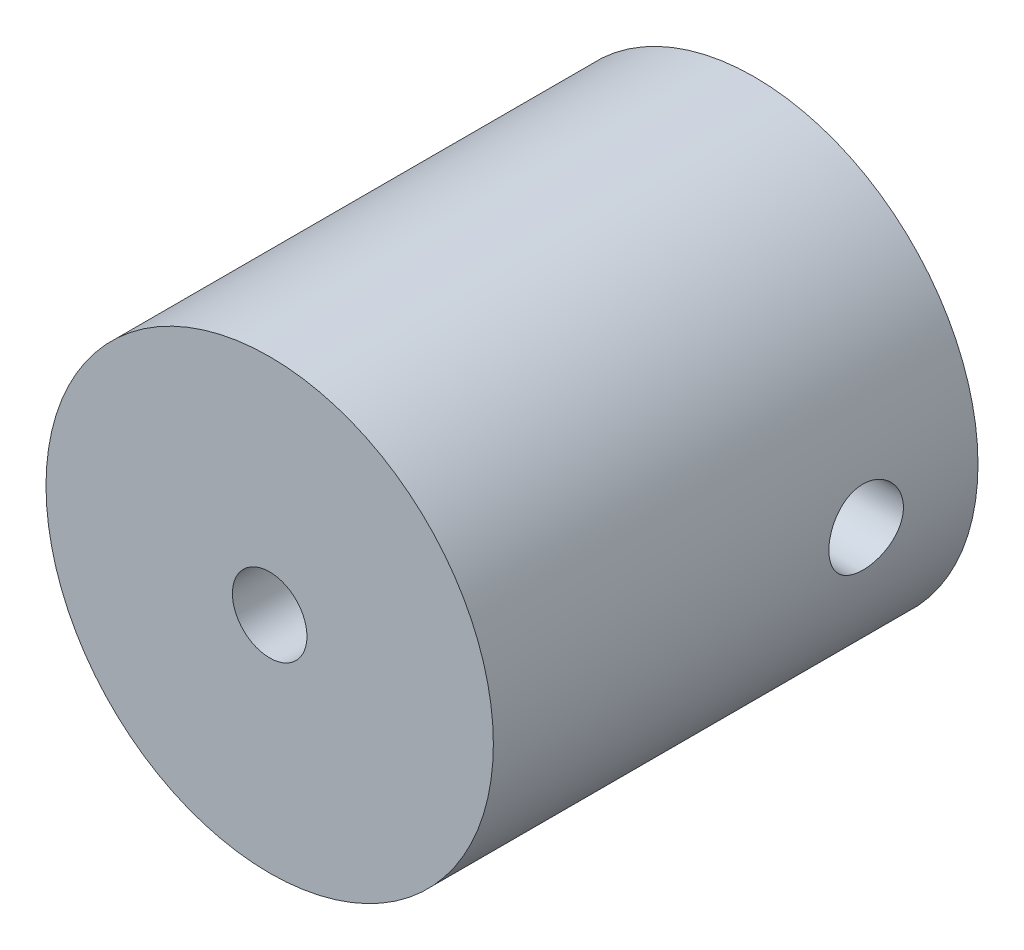
ISO-10303-21;
HEADER;
FILE_DESCRIPTION(('STEP AP214'),'2;1');
FILE_NAME('part.step','',(''),(''),'','','');
FILE_SCHEMA(('AUTOMOTIVE_DESIGN { 1 0 10303 214 1 1 1 1 }'));
ENDSEC;
DATA;
#1=APPLICATION_CONTEXT('core data for automotive mechanical design processes');
#2=APPLICATION_PROTOCOL_DEFINITION('international standard','automotive_design',2000,#1);
#3=PRODUCT_CONTEXT('',#1,'mechanical');
#4=PRODUCT('Part','Part','',(#3));
#5=PRODUCT_RELATED_PRODUCT_CATEGORY('part','',(#4));
#6=PRODUCT_DEFINITION_FORMATION('','',#4);
#7=PRODUCT_DEFINITION_CONTEXT('part definition',#1,'design');
#8=PRODUCT_DEFINITION('design','',#6,#7);
#9=PRODUCT_DEFINITION_SHAPE('','',#8);
#10=(LENGTH_UNIT() NAMED_UNIT(*) SI_UNIT(.MILLI.,.METRE.));
#11=(NAMED_UNIT(*) PLANE_ANGLE_UNIT() SI_UNIT($,.RADIAN.));
#12=(NAMED_UNIT(*) SI_UNIT($,.STERADIAN.) SOLID_ANGLE_UNIT());
#13=UNCERTAINTY_MEASURE_WITH_UNIT(LENGTH_MEASURE(1.E-05),#10,'distance_accuracy_value','');
#14=(GEOMETRIC_REPRESENTATION_CONTEXT(3) GLOBAL_UNCERTAINTY_ASSIGNED_CONTEXT((#13)) GLOBAL_UNIT_ASSIGNED_CONTEXT((#10,
#11,#12)) REPRESENTATION_CONTEXT('',''));
#15=CARTESIAN_POINT('',(0.,0.,0.));
#16=DIRECTION('',(0.,0.,1.));
#17=DIRECTION('',(1.,0.,0.));
#18=AXIS2_PLACEMENT_3D('',#15,#16,#17);
#19=CARTESIAN_POINT('',(0.,0.,32.5));
#20=DIRECTION('',(0.,0.,-1.));
#21=DIRECTION('',(-1.,0.,0.));
#22=AXIS2_PLACEMENT_3D('',#19,#20,#21);
#23=CYLINDRICAL_SURFACE('',#22,15.);
#24=CARTESIAN_POINT('',(0.,0.,32.5));
#25=DIRECTION('',(0.,0.,1.));
#26=DIRECTION('',(1.,0.,0.));
#27=AXIS2_PLACEMENT_3D('',#24,#25,#26);
#28=CIRCLE('',#27,15.);
#29=CARTESIAN_POINT('',(15.,0.,32.5));
#30=VERTEX_POINT('',#29);
#31=EDGE_CURVE('E70',#30,#30,#28,.T.);
#32=ORIENTED_EDGE('',*,*,#31,.F.);
#33=EDGE_LOOP('',(#32));
#34=FACE_BOUND('',#33,.T.);
#35=CARTESIAN_POINT('',(0.,0.,0.));
#36=DIRECTION('',(0.,0.,1.));
#37=DIRECTION('',(1.,0.,0.));
#38=AXIS2_PLACEMENT_3D('',#35,#36,#37);
#39=CIRCLE('',#38,15.);
#40=CARTESIAN_POINT('',(15.,0.,0.));
#41=VERTEX_POINT('',#40);
#42=EDGE_CURVE('E76',#41,#41,#39,.T.);
#43=ORIENTED_EDGE('',*,*,#42,.T.);
#44=EDGE_LOOP('',(#43));
#45=FACE_BOUND('',#44,.T.);
#46=CARTESIAN_POINT('',(15.,0.,10.));
#47=CARTESIAN_POINT('',(14.9999976116882,-0.139390904958216,9.99999441105218));
#48=CARTESIAN_POINT('',(14.9980367791303,-0.278857881838822,9.98830272503108));
#49=CARTESIAN_POINT('',(14.9904034494139,-0.553880221673044,9.94186434123467));
#50=CARTESIAN_POINT('',(14.9847275392389,-0.689431867959248,9.9070964430884));
#51=CARTESIAN_POINT('',(14.9703006823645,-0.952604747212645,9.81558455140724));
#52=CARTESIAN_POINT('',(14.9615522515919,-1.0802323684319,9.75885853435943));
#53=CARTESIAN_POINT('',(14.9419422708207,-1.32414184197795,9.6250877079476));
#54=CARTESIAN_POINT('',(14.9310809625443,-1.44042498987859,9.548045222517));
#55=CARTESIAN_POINT('',(14.9083331745831,-1.65947261429168,9.37504491617954));
#56=CARTESIAN_POINT('',(14.8964387181486,-1.76211290353497,9.27893088536387));
#57=CARTESIAN_POINT('',(14.8730262687673,-1.94988849865993,9.07085203152719));
#58=CARTESIAN_POINT('',(14.8615082996267,-2.03502269939097,8.95888620854339));
#59=CARTESIAN_POINT('',(14.8400756575978,-2.18586712560513,8.72142903380294));
#60=CARTESIAN_POINT('',(14.8301712909164,-2.251454552861,8.59585866319524));
#61=CARTESIAN_POINT('',(14.8131978979467,-2.36055836541122,8.33529043569937));
#62=CARTESIAN_POINT('',(14.8061286801431,-2.40407624156561,8.20029321632237));
#63=CARTESIAN_POINT('',(14.7957053684275,-2.46741437778481,7.92601972514346));
#64=CARTESIAN_POINT('',(14.792317684857,-2.4874490291354,7.78679426349861));
#65=CARTESIAN_POINT('',(14.7895393893665,-2.50391672528988,7.50691972311653));
#66=CARTESIAN_POINT('',(14.7901484945721,-2.500351440389,7.3662707458327));
#67=CARTESIAN_POINT('',(14.7952642886355,-2.46989509839615,7.08907213872455));
#68=CARTESIAN_POINT('',(14.7997307331892,-2.44324488188977,6.95249519645477));
#69=CARTESIAN_POINT('',(14.8119949521101,-2.36775314040345,6.68577868217087));
#70=CARTESIAN_POINT('',(14.8197928407327,-2.31891085431974,6.55563933111145));
#71=CARTESIAN_POINT('',(14.837884793341,-2.20017724609391,6.30477117655908));
#72=CARTESIAN_POINT('',(14.8481906710733,-2.13018591387971,6.18409059391877));
#73=CARTESIAN_POINT('',(14.8701291841501,-1.97121201755743,5.95609559946162));
#74=CARTESIAN_POINT('',(14.8817619265429,-1.88222792065429,5.84878226754507));
#75=CARTESIAN_POINT('',(14.9052202787979,-1.68648221215906,5.64917391419265));
#76=CARTESIAN_POINT('',(14.9170464923165,-1.57951396387313,5.55708148145992));
#77=CARTESIAN_POINT('',(14.9394260139672,-1.35153524898165,5.39212223733466));
#78=CARTESIAN_POINT('',(14.9499793138975,-1.23052469190642,5.31925554981677));
#79=CARTESIAN_POINT('',(14.9686389289291,-0.977705916166712,5.19479777286372));
#80=CARTESIAN_POINT('',(14.9767431840745,-0.845888725564662,5.14322458066874));
#81=CARTESIAN_POINT('',(14.9895750301266,-0.575298345602732,5.06300578475402));
#82=CARTESIAN_POINT('',(14.9943029035047,-0.436525739179469,5.03435826302628));
#83=CARTESIAN_POINT('',(14.9998112984269,-0.157709901301625,5.00107864153887));
#84=CARTESIAN_POINT('',(15.0006375301278,-0.0177007371510127,4.99616842819439));
#85=CARTESIAN_POINT('',(14.9983747442117,0.261139772889886,5.00976134442812));
#86=CARTESIAN_POINT('',(14.9952858772412,0.399971163892038,5.02826357313374));
#87=CARTESIAN_POINT('',(14.985568269382,0.671656175546762,5.08792484933548));
#88=CARTESIAN_POINT('',(14.9789610480131,0.804540868385378,5.12894620839012));
#89=CARTESIAN_POINT('',(14.9629446445536,1.06154688486044,5.23233451819953));
#90=CARTESIAN_POINT('',(14.9535353051202,1.18566771590972,5.29470266763527));
#91=CARTESIAN_POINT('',(14.9328451630241,1.42283068946896,5.43965112469679));
#92=CARTESIAN_POINT('',(14.9215485588702,1.53576525093715,5.52240515616725));
#93=CARTESIAN_POINT('',(14.898384673919,1.74624358550269,5.70553731538506));
#94=CARTESIAN_POINT('',(14.8865173517155,1.84378623969658,5.80591672327667));
#95=CARTESIAN_POINT('',(14.8634017523585,2.021742779658,6.02269754807142));
#96=CARTESIAN_POINT('',(14.8521611613711,2.10196876111371,6.13925416551441));
#97=CARTESIAN_POINT('',(14.8317152977788,2.24170231029498,6.38435296913854));
#98=CARTESIAN_POINT('',(14.8225099606602,2.30121053476982,6.51289477522749));
#99=CARTESIAN_POINT('',(14.807234536977,2.39753833147315,6.77778973281213));
#100=CARTESIAN_POINT('',(14.8011515431106,2.43445143254794,6.91410809503049));
#101=CARTESIAN_POINT('',(14.7927771683526,2.48483545377828,7.19112012922176));
#102=CARTESIAN_POINT('',(14.7904854578272,2.49830841194617,7.33181341973205));
#103=CARTESIAN_POINT('',(14.7899673308401,2.50137286604735,7.61170516596241));
#104=CARTESIAN_POINT('',(14.7916905650565,2.49126013612519,7.75090037857529));
#105=CARTESIAN_POINT('',(14.7988978145373,2.44807983895685,8.02557924805076));
#106=CARTESIAN_POINT('',(14.8043818176121,2.41501234611248,8.16106291694187));
#107=CARTESIAN_POINT('',(14.8184735628172,2.3269744895949,8.42435843729261));
#108=CARTESIAN_POINT('',(14.8270776721967,2.27202959060044,8.55217901005602));
#109=CARTESIAN_POINT('',(14.8464436892221,2.14182700391591,8.79683566919485));
#110=CARTESIAN_POINT('',(14.857205703884,2.06656830874856,8.91367121037213));
#111=CARTESIAN_POINT('',(14.8798345404562,1.89681888437215,9.13453558310775));
#112=CARTESIAN_POINT('',(14.891712955763,1.80211056359365,9.23839601670027));
#113=CARTESIAN_POINT('',(14.9151437236084,1.59660903138023,9.42885160447494));
#114=CARTESIAN_POINT('',(14.9266960002655,1.48581211291264,9.51544276863817));
#115=CARTESIAN_POINT('',(14.9482652964222,1.25036916964028,9.66944826819994));
#116=CARTESIAN_POINT('',(14.958271162531,1.12563278753282,9.73672603931295));
#117=CARTESIAN_POINT('',(14.9755116760178,0.866513069378981,9.84926948460992));
#118=CARTESIAN_POINT('',(14.9827490817748,0.73213949483001,9.8945570810797));
#119=CARTESIAN_POINT('',(14.9920579083296,0.497703310045401,9.95200527412666));
#120=CARTESIAN_POINT('',(14.9950202727336,0.399058830298447,9.96997446961596));
#121=CARTESIAN_POINT('',(14.9989921598612,0.200289310319809,9.99397373784475));
#122=CARTESIAN_POINT('',(15.0000017162064,0.100164295608494,10.0000040161374));
#123=CARTESIAN_POINT('',(15.,0.,10.));
#124=B_SPLINE_CURVE_WITH_KNOTS('',3,(#46,#47,#48,#49,#50,#51,#52,#53,#54,#55,#56,#57,#58,#59,
#60,#61,#62,#63,#64,#65,#66,#67,#68,#69,#70,#71,#72,#73,#74,#75,#76,#77,#78,#79,#80,#81,#82,#83,
#84,#85,#86,#87,#88,#89,#90,#91,#92,#93,#94,#95,#96,#97,#98,#99,#100,#101,#102,#103,#104,#105,
#106,#107,#108,#109,#110,#111,#112,#113,#114,#115,#116,#117,#118,#119,#120,#121,#122,#123),
.UNSPECIFIED.,.T.,.F.,(4,2,2,2,2,2,2,2,2,2,2,2,2,2,2,2,2,2,2,2,2,2,2,2,2,2,2,2,2,2,2,2,2,2,2,2,
2,2,4),(0.,0.417806584938509,0.83599754569542,1.25384686702527,1.67164841267479,
2.09302491062332,2.51442800169857,2.9384252082384,3.36239376876181,3.78246077103424,
4.20249804320886,4.61820521760409,5.03392665025381,5.45164556632557,5.86939820680573,
6.29232769911327,6.71525991635848,7.13854688915903,7.56179844521149,7.98007883491397,
8.3983431303586,8.81407807006415,9.22983635826066,9.64926825627024,10.0687306305428,
10.4925382200762,10.9163323737594,11.3383602234177,11.7603513778662,12.177079095227,
12.5938054618813,13.0100481822622,13.4263115502934,13.8475138419339,14.2688133387897,
14.693022316072,15.1168075213007,15.4170424816402,15.7172722727697),.UNSPECIFIED.);
#125=CARTESIAN_POINT('',(15.,0.,10.));
#126=VERTEX_POINT('',#125);
#127=EDGE_CURVE('E99',#126,#126,#124,.T.);
#128=ORIENTED_EDGE('',*,*,#127,.F.);
#129=EDGE_LOOP('',(#128));
#130=FACE_BOUND('',#129,.T.);
#131=CARTESIAN_POINT('',(-15.,0.,10.));
#132=CARTESIAN_POINT('',(-14.9999976116882,0.139390904958215,9.99999441105218));
#133=CARTESIAN_POINT('',(-14.9980367791303,0.278857881838821,9.98830272503108));
#134=CARTESIAN_POINT('',(-14.9904034494139,0.553880221673043,9.94186434123467));
#135=CARTESIAN_POINT('',(-14.9847275392389,0.689431867959247,9.9070964430884));
#136=CARTESIAN_POINT('',(-14.9703006823645,0.952604747212644,9.81558455140724));
#137=CARTESIAN_POINT('',(-14.9615522515919,1.0802323684319,9.75885853435943));
#138=CARTESIAN_POINT('',(-14.9419422708207,1.32414184197794,9.6250877079476));
#139=CARTESIAN_POINT('',(-14.9310809625443,1.44042498987859,9.548045222517));
#140=CARTESIAN_POINT('',(-14.9083331745831,1.65947261429168,9.37504491617954));
#141=CARTESIAN_POINT('',(-14.8964387181486,1.76211290353497,9.27893088536387));
#142=CARTESIAN_POINT('',(-14.8730262687673,1.94988849865993,9.07085203152719));
#143=CARTESIAN_POINT('',(-14.8615082996267,2.03502269939097,8.95888620854339));
#144=CARTESIAN_POINT('',(-14.8400756575978,2.18586712560513,8.72142903380294));
#145=CARTESIAN_POINT('',(-14.8301712909164,2.251454552861,8.59585866319524));
#146=CARTESIAN_POINT('',(-14.8131978979467,2.36055836541122,8.33529043569937));
#147=CARTESIAN_POINT('',(-14.8061286801431,2.40407624156561,8.20029321632236));
#148=CARTESIAN_POINT('',(-14.7957053684276,2.46741437778481,7.92601972514346));
#149=CARTESIAN_POINT('',(-14.792317684857,2.4874490291354,7.78679426349861));
#150=CARTESIAN_POINT('',(-14.7895393893665,2.50391672528987,7.50691972311653));
#151=CARTESIAN_POINT('',(-14.7901484945721,2.500351440389,7.3662707458327));
#152=CARTESIAN_POINT('',(-14.7952642886355,2.46989509839615,7.08907213872455));
#153=CARTESIAN_POINT('',(-14.7997307331892,2.44324488188977,6.95249519645477));
#154=CARTESIAN_POINT('',(-14.8119949521101,2.36775314040344,6.68577868217087));
#155=CARTESIAN_POINT('',(-14.8197928407327,2.31891085431974,6.55563933111145));
#156=CARTESIAN_POINT('',(-14.837884793341,2.20017724609391,6.30477117655908));
#157=CARTESIAN_POINT('',(-14.8481906710733,2.13018591387971,6.18409059391877));
#158=CARTESIAN_POINT('',(-14.8701291841501,1.97121201755743,5.95609559946161));
#159=CARTESIAN_POINT('',(-14.8817619265429,1.88222792065429,5.84878226754507));
#160=CARTESIAN_POINT('',(-14.9052202787979,1.68648221215905,5.64917391419265));
#161=CARTESIAN_POINT('',(-14.9170464923165,1.57951396387313,5.55708148145992));
#162=CARTESIAN_POINT('',(-14.9394260139672,1.35153524898164,5.39212223733466));
#163=CARTESIAN_POINT('',(-14.9499793138975,1.23052469190642,5.31925554981677));
#164=CARTESIAN_POINT('',(-14.9686389289291,0.977705916166709,5.19479777286372));
#165=CARTESIAN_POINT('',(-14.9767431840745,0.845888725564659,5.14322458066874));
#166=CARTESIAN_POINT('',(-14.9895750301266,0.575298345602729,5.06300578475402));
#167=CARTESIAN_POINT('',(-14.9943029035047,0.436525739179466,5.03435826302628));
#168=CARTESIAN_POINT('',(-14.9998112984269,0.157709901301622,5.00107864153887));
#169=CARTESIAN_POINT('',(-15.0006375301278,0.0177007371510091,4.99616842819439));
#170=CARTESIAN_POINT('',(-14.9983747442117,-0.26113977288989,5.00976134442812));
#171=CARTESIAN_POINT('',(-14.9952858772412,-0.399971163892041,5.02826357313374));
#172=CARTESIAN_POINT('',(-14.985568269382,-0.671656175546765,5.08792484933548));
#173=CARTESIAN_POINT('',(-14.9789610480131,-0.804540868385381,5.12894620839012));
#174=CARTESIAN_POINT('',(-14.9629446445536,-1.06154688486044,5.23233451819953));
#175=CARTESIAN_POINT('',(-14.9535353051202,-1.18566771590972,5.29470266763527));
#176=CARTESIAN_POINT('',(-14.9328451630241,-1.42283068946896,5.43965112469679));
#177=CARTESIAN_POINT('',(-14.9215485588702,-1.53576525093715,5.52240515616725));
#178=CARTESIAN_POINT('',(-14.898384673919,-1.74624358550269,5.70553731538506));
#179=CARTESIAN_POINT('',(-14.8865173517155,-1.84378623969658,5.80591672327667));
#180=CARTESIAN_POINT('',(-14.8634017523585,-2.021742779658,6.02269754807142));
#181=CARTESIAN_POINT('',(-14.8521611613711,-2.10196876111372,6.13925416551441));
#182=CARTESIAN_POINT('',(-14.8317152977788,-2.24170231029499,6.38435296913854));
#183=CARTESIAN_POINT('',(-14.8225099606602,-2.30121053476982,6.51289477522749));
#184=CARTESIAN_POINT('',(-14.807234536977,-2.39753833147315,6.77778973281213));
#185=CARTESIAN_POINT('',(-14.8011515431106,-2.43445143254795,6.91410809503049));
#186=CARTESIAN_POINT('',(-14.7927771683526,-2.48483545377828,7.19112012922176));
#187=CARTESIAN_POINT('',(-14.7904854578272,-2.49830841194617,7.33181341973205));
#188=CARTESIAN_POINT('',(-14.7899673308401,-2.50137286604735,7.61170516596241));
#189=CARTESIAN_POINT('',(-14.7916905650565,-2.49126013612519,7.75090037857529));
#190=CARTESIAN_POINT('',(-14.7988978145373,-2.44807983895685,8.02557924805076));
#191=CARTESIAN_POINT('',(-14.8043818176121,-2.41501234611248,8.16106291694187));
#192=CARTESIAN_POINT('',(-14.8184735628172,-2.3269744895949,8.42435843729261));
#193=CARTESIAN_POINT('',(-14.8270776721967,-2.27202959060044,8.55217901005602));
#194=CARTESIAN_POINT('',(-14.8464436892221,-2.14182700391591,8.79683566919485));
#195=CARTESIAN_POINT('',(-14.857205703884,-2.06656830874856,8.91367121037213));
#196=CARTESIAN_POINT('',(-14.8798345404562,-1.89681888437216,9.13453558310775));
#197=CARTESIAN_POINT('',(-14.891712955763,-1.80211056359365,9.23839601670027));
#198=CARTESIAN_POINT('',(-14.9151437236084,-1.59660903138023,9.42885160447494));
#199=CARTESIAN_POINT('',(-14.9266960002655,-1.48581211291264,9.51544276863817));
#200=CARTESIAN_POINT('',(-14.9482652964222,-1.25036916964028,9.66944826819994));
#201=CARTESIAN_POINT('',(-14.958271162531,-1.12563278753282,9.73672603931295));
#202=CARTESIAN_POINT('',(-14.9755116760178,-0.866513069378982,9.84926948460992));
#203=CARTESIAN_POINT('',(-14.9827490817748,-0.732139494830011,9.8945570810797));
#204=CARTESIAN_POINT('',(-14.9920579083296,-0.497703310045402,9.95200527412666));
#205=CARTESIAN_POINT('',(-14.9950202727336,-0.399058830298449,9.96997446961596));
#206=CARTESIAN_POINT('',(-14.9989921598612,-0.20028931031981,9.99397373784475));
#207=CARTESIAN_POINT('',(-15.0000017162064,-0.100164295608495,10.0000040161374));
#208=CARTESIAN_POINT('',(-15.,0.,10.));
#209=B_SPLINE_CURVE_WITH_KNOTS('',3,(#131,#132,#133,#134,#135,#136,#137,#138,#139,#140,#141,
#142,#143,#144,#145,#146,#147,#148,#149,#150,#151,#152,#153,#154,#155,#156,#157,#158,#159,#160,
#161,#162,#163,#164,#165,#166,#167,#168,#169,#170,#171,#172,#173,#174,#175,#176,#177,#178,#179,
#180,#181,#182,#183,#184,#185,#186,#187,#188,#189,#190,#191,#192,#193,#194,#195,#196,#197,#198,
#199,#200,#201,#202,#203,#204,#205,#206,#207,#208),.UNSPECIFIED.,.T.,.F.,(4,2,2,2,2,2,2,2,2,2,2,
2,2,2,2,2,2,2,2,2,2,2,2,2,2,2,2,2,2,2,2,2,2,2,2,2,2,2,4),(0.,0.417806584938509,
0.835997545695421,1.25384686702527,1.67164841267479,2.09302491062332,2.51442800169857,
2.9384252082384,3.36239376876181,3.78246077103424,4.20249804320886,4.61820521760409,
5.03392665025381,5.45164556632557,5.86939820680573,6.29232769911327,6.71525991635848,
7.13854688915903,7.56179844521149,7.98007883491397,8.3983431303586,8.81407807006415,
9.22983635826066,9.64926825627024,10.0687306305428,10.4925382200762,10.9163323737594,
11.3383602234177,11.7603513778662,12.177079095227,12.5938054618813,13.0100481822622,
13.4263115502934,13.8475138419339,14.2688133387897,14.693022316072,15.1168075213007,
15.4170424816402,15.7172722727697),.UNSPECIFIED.);
#210=CARTESIAN_POINT('',(-15.,0.,10.));
#211=VERTEX_POINT('',#210);
#212=EDGE_CURVE('E88',#211,#211,#209,.T.);
#213=ORIENTED_EDGE('',*,*,#212,.F.);
#214=EDGE_LOOP('',(#213));
#215=FACE_BOUND('',#214,.T.);
#216=ADVANCED_FACE('F39',(#34,#45,#130,#215),#23,.T.);
#217=CARTESIAN_POINT('',(0.,0.,32.5));
#218=DIRECTION('',(0.,0.,-1.));
#219=DIRECTION('',(-1.,0.,0.));
#220=AXIS2_PLACEMENT_3D('',#217,#218,#219);
#221=CYLINDRICAL_SURFACE('',#220,2.5);
#222=CARTESIAN_POINT('',(0.,0.,0.));
#223=DIRECTION('',(0.,0.,1.));
#224=DIRECTION('',(1.,0.,0.));
#225=AXIS2_PLACEMENT_3D('',#222,#223,#224);
#226=CIRCLE('',#225,2.5);
#227=CARTESIAN_POINT('',(2.5,0.,0.));
#228=VERTEX_POINT('',#227);
#229=EDGE_CURVE('E84',#228,#228,#226,.T.);
#230=ORIENTED_EDGE('',*,*,#229,.F.);
#231=EDGE_LOOP('',(#230));
#232=FACE_BOUND('',#231,.T.);
#233=CARTESIAN_POINT('',(0.,0.,7.5));
#234=DIRECTION('',(0.707106781186547,0.,-0.707106781186547));
#235=DIRECTION('',(-0.707106781186547,0.,-0.707106781186547));
#236=AXIS2_PLACEMENT_3D('',#233,#234,#235);
#237=ELLIPSE('',#236,3.53553390593274,2.5);
#238=CARTESIAN_POINT('',(0.,2.5,7.5));
#239=VERTEX_POINT('',#238);
#240=CARTESIAN_POINT('',(0.,-2.5,7.5));
#241=VERTEX_POINT('',#240);
#242=EDGE_CURVE('E53',#239,#241,#237,.F.);
#243=ORIENTED_EDGE('',*,*,#242,.T.);
#244=CARTESIAN_POINT('',(0.,0.,7.5));
#245=DIRECTION('',(-0.707106781186547,0.,-0.707106781186547));
#246=DIRECTION('',(0.707106781186547,0.,-0.707106781186547));
#247=AXIS2_PLACEMENT_3D('',#244,#245,#246);
#248=ELLIPSE('',#247,3.53553390593274,2.5);
#249=EDGE_CURVE('E11',#241,#239,#248,.F.);
#250=ORIENTED_EDGE('',*,*,#249,.T.);
#251=EDGE_LOOP('',(#243,#250));
#252=FACE_BOUND('',#251,.T.);
#253=ADVANCED_FACE('F72',(#232,#252),#221,.F.);
#254=CARTESIAN_POINT('',(0.,0.,32.5));
#255=DIRECTION('',(0.,0.,1.));
#256=DIRECTION('',(1.,0.,0.));
#257=AXIS2_PLACEMENT_3D('',#254,#255,#256);
#258=CIRCLE('',#257,2.5);
#259=CARTESIAN_POINT('',(2.5,0.,32.5));
#260=VERTEX_POINT('',#259);
#261=EDGE_CURVE('E80',#260,#260,#258,.T.);
#262=ORIENTED_EDGE('',*,*,#261,.T.);
#263=EDGE_LOOP('',(#262));
#264=FACE_BOUND('',#263,.T.);
#265=CARTESIAN_POINT('',(0.,0.,7.5));
#266=DIRECTION('',(0.707106781186547,0.,-0.707106781186547));
#267=DIRECTION('',(-0.707106781186547,0.,-0.707106781186547));
#268=AXIS2_PLACEMENT_3D('',#265,#266,#267);
#269=ELLIPSE('',#268,3.53553390593274,2.5);
#270=EDGE_CURVE('E59',#239,#241,#269,.T.);
#271=ORIENTED_EDGE('',*,*,#270,.T.);
#272=CARTESIAN_POINT('',(0.,0.,7.5));
#273=DIRECTION('',(-0.707106781186547,0.,-0.707106781186547));
#274=DIRECTION('',(0.707106781186547,0.,-0.707106781186547));
#275=AXIS2_PLACEMENT_3D('',#272,#273,#274);
#276=ELLIPSE('',#275,3.53553390593274,2.5);
#277=EDGE_CURVE('E48',#241,#239,#276,.T.);
#278=ORIENTED_EDGE('',*,*,#277,.T.);
#279=EDGE_LOOP('',(#271,#278));
#280=FACE_BOUND('',#279,.T.);
#281=ADVANCED_FACE('F73',(#264,#280),#221,.F.);
#282=CARTESIAN_POINT('',(0.,0.,32.5));
#283=DIRECTION('',(0.,0.,1.));
#284=DIRECTION('',(1.,0.,0.));
#285=AXIS2_PLACEMENT_3D('',#282,#283,#284);
#286=PLANE('',#285);
#287=ORIENTED_EDGE('',*,*,#31,.T.);
#288=EDGE_LOOP('',(#287));
#289=FACE_BOUND('',#288,.T.);
#290=ORIENTED_EDGE('',*,*,#261,.F.);
#291=EDGE_LOOP('',(#290));
#292=FACE_BOUND('',#291,.T.);
#293=ADVANCED_FACE('F111',(#289,#292),#286,.T.);
#294=CARTESIAN_POINT('',(0.,0.,0.));
#295=DIRECTION('',(0.,0.,1.));
#296=DIRECTION('',(1.,0.,0.));
#297=AXIS2_PLACEMENT_3D('',#294,#295,#296);
#298=PLANE('',#297);
#299=ORIENTED_EDGE('',*,*,#42,.F.);
#300=EDGE_LOOP('',(#299));
#301=FACE_BOUND('',#300,.T.);
#302=ORIENTED_EDGE('',*,*,#229,.T.);
#303=EDGE_LOOP('',(#302));
#304=FACE_BOUND('',#303,.T.);
#305=ADVANCED_FACE('F106',(#301,#304),#298,.F.);
#306=CARTESIAN_POINT('',(32.5,0.,7.5));
#307=DIRECTION('',(-1.,0.,0.));
#308=DIRECTION('',(0.,0.,1.));
#309=AXIS2_PLACEMENT_3D('',#306,#307,#308);
#310=CYLINDRICAL_SURFACE('',#309,2.5);
#311=ORIENTED_EDGE('',*,*,#242,.F.);
#312=ORIENTED_EDGE('',*,*,#277,.F.);
#313=EDGE_LOOP('',(#311,#312));
#314=FACE_BOUND('',#313,.T.);
#315=ORIENTED_EDGE('',*,*,#212,.T.);
#316=EDGE_LOOP('',(#315));
#317=FACE_BOUND('',#316,.T.);
#318=ADVANCED_FACE('F67',(#314,#317),#310,.F.);
#319=ORIENTED_EDGE('',*,*,#270,.F.);
#320=ORIENTED_EDGE('',*,*,#249,.F.);
#321=EDGE_LOOP('',(#319,#320));
#322=FACE_BOUND('',#321,.T.);
#323=ORIENTED_EDGE('',*,*,#127,.T.);
#324=EDGE_LOOP('',(#323));
#325=FACE_BOUND('',#324,.T.);
#326=ADVANCED_FACE('F60',(#322,#325),#310,.F.);
#327=CLOSED_SHELL('',(#216,#253,#281,#293,#305,#318,#326));
#328=MANIFOLD_SOLID_BREP('B2',#327);
#329=ADVANCED_BREP_SHAPE_REPRESENTATION('',(#18,#328),#14);
#330=SHAPE_DEFINITION_REPRESENTATION(#9,#329);
ENDSEC;
END-ISO-10303-21;
